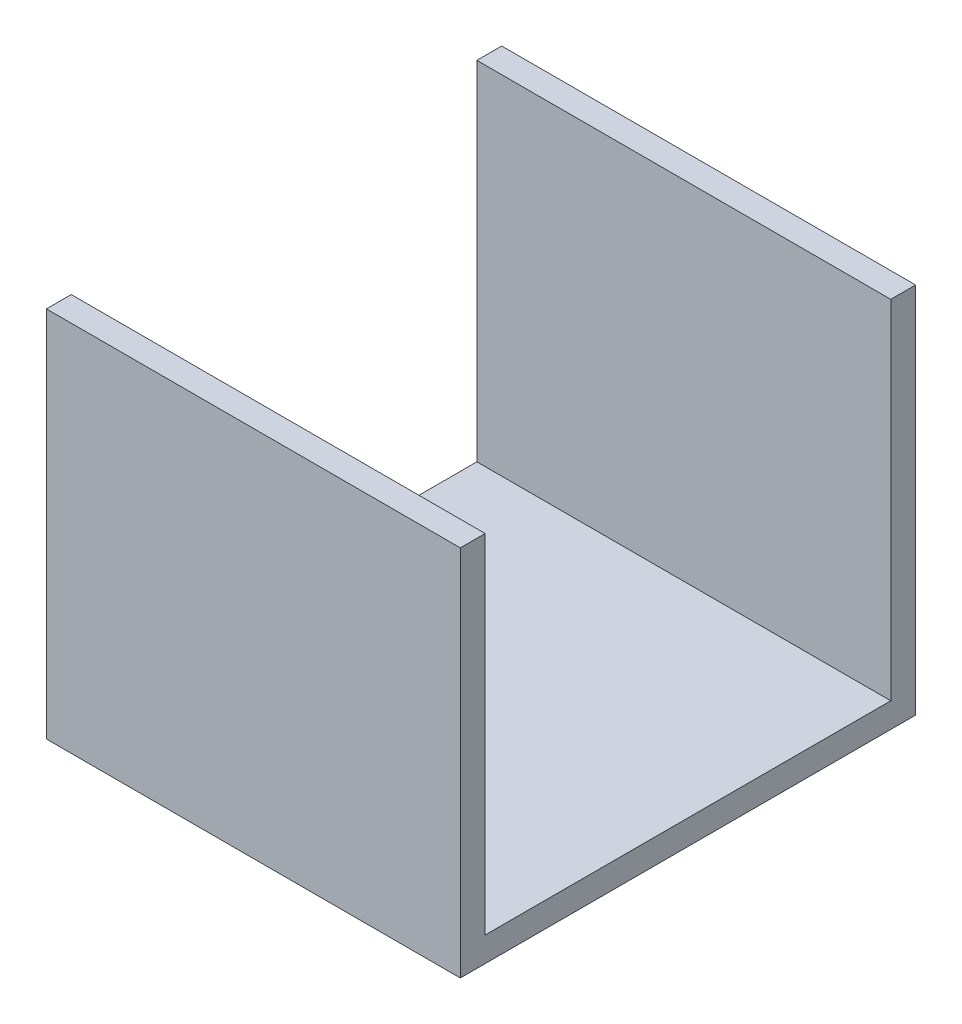
ISO-10303-21;
HEADER;
FILE_DESCRIPTION(('STEP AP214'),'2;1');
FILE_NAME('part.step','',(''),(''),'','','');
FILE_SCHEMA(('AUTOMOTIVE_DESIGN { 1 0 10303 214 1 1 1 1 }'));
ENDSEC;
DATA;
#1=APPLICATION_CONTEXT('core data for automotive mechanical design processes');
#2=APPLICATION_PROTOCOL_DEFINITION('international standard','automotive_design',2000,#1);
#3=PRODUCT_CONTEXT('',#1,'mechanical');
#4=PRODUCT('Part','Part','',(#3));
#5=PRODUCT_RELATED_PRODUCT_CATEGORY('part','',(#4));
#6=PRODUCT_DEFINITION_FORMATION('','',#4);
#7=PRODUCT_DEFINITION_CONTEXT('part definition',#1,'design');
#8=PRODUCT_DEFINITION('design','',#6,#7);
#9=PRODUCT_DEFINITION_SHAPE('','',#8);
#10=(LENGTH_UNIT() NAMED_UNIT(*) SI_UNIT(.MILLI.,.METRE.));
#11=(NAMED_UNIT(*) PLANE_ANGLE_UNIT() SI_UNIT($,.RADIAN.));
#12=(NAMED_UNIT(*) SI_UNIT($,.STERADIAN.) SOLID_ANGLE_UNIT());
#13=UNCERTAINTY_MEASURE_WITH_UNIT(LENGTH_MEASURE(1.E-05),#10,'distance_accuracy_value','');
#14=(GEOMETRIC_REPRESENTATION_CONTEXT(3) GLOBAL_UNCERTAINTY_ASSIGNED_CONTEXT((#13)) GLOBAL_UNIT_ASSIGNED_CONTEXT((#10,
#11,#12)) REPRESENTATION_CONTEXT('',''));
#15=CARTESIAN_POINT('',(0.,0.,0.));
#16=DIRECTION('',(0.,0.,1.));
#17=DIRECTION('',(1.,0.,0.));
#18=AXIS2_PLACEMENT_3D('',#15,#16,#17);
#19=CARTESIAN_POINT('',(1.45,0.005,0.));
#20=DIRECTION('',(0.,-1.,0.));
#21=DIRECTION('',(0.707106781186548,0.,0.707106781186548));
#22=AXIS2_PLACEMENT_3D('',#19,#20,#21);
#23=PLANE('',#22);
#24=DIRECTION('',(1.,0.,0.));
#25=VECTOR('',#24,1.);
#26=CARTESIAN_POINT('',(1.45,0.005,0.03));
#27=LINE('',#26,#25);
#28=CARTESIAN_POINT('',(1.45,0.005,0.03));
#29=VERTEX_POINT('',#28);
#30=CARTESIAN_POINT('',(1.95,0.005,0.03));
#31=VERTEX_POINT('',#30);
#32=EDGE_CURVE('E34',#29,#31,#27,.T.);
#33=ORIENTED_EDGE('',*,*,#32,.F.);
#34=DIRECTION('',(0.,0.,1.));
#35=VECTOR('',#34,1.);
#36=CARTESIAN_POINT('',(1.45,0.005,0.03));
#37=LINE('',#36,#35);
#38=CARTESIAN_POINT('',(1.45,0.005,0.52));
#39=VERTEX_POINT('',#38);
#40=EDGE_CURVE('E11',#29,#39,#37,.T.);
#41=ORIENTED_EDGE('',*,*,#40,.T.);
#42=DIRECTION('',(1.,0.,0.));
#43=VECTOR('',#42,1.);
#44=CARTESIAN_POINT('',(1.45,0.005,0.52));
#45=LINE('',#44,#43);
#46=CARTESIAN_POINT('',(1.95,0.005,0.52));
#47=VERTEX_POINT('',#46);
#48=EDGE_CURVE('E26',#39,#47,#45,.T.);
#49=ORIENTED_EDGE('',*,*,#48,.T.);
#50=DIRECTION('',(0.,0.,1.));
#51=VECTOR('',#50,1.);
#52=CARTESIAN_POINT('',(1.95,0.005,0.03));
#53=LINE('',#52,#51);
#54=EDGE_CURVE('E139',#31,#47,#53,.T.);
#55=ORIENTED_EDGE('',*,*,#54,.F.);
#56=EDGE_LOOP('',(#33,#41,#49,#55));
#57=FACE_BOUND('',#56,.T.);
#58=ADVANCED_FACE('F16',(#57),#23,.F.);
#59=CARTESIAN_POINT('',(1.6,0.,0.52));
#60=DIRECTION('',(0.,0.,1.));
#61=DIRECTION('',(0.707106781186548,0.707106781186548,0.));
#62=AXIS2_PLACEMENT_3D('',#59,#60,#61);
#63=PLANE('',#62);
#64=DIRECTION('',(-1.,0.,0.));
#65=VECTOR('',#64,1.);
#66=CARTESIAN_POINT('',(1.95,0.425,0.52));
#67=LINE('',#66,#65);
#68=CARTESIAN_POINT('',(1.95,0.425,0.52));
#69=VERTEX_POINT('',#68);
#70=CARTESIAN_POINT('',(1.45,0.425,0.52));
#71=VERTEX_POINT('',#70);
#72=EDGE_CURVE('E122',#69,#71,#67,.T.);
#73=ORIENTED_EDGE('',*,*,#72,.F.);
#74=DIRECTION('',(0.,1.,0.));
#75=VECTOR('',#74,1.);
#76=CARTESIAN_POINT('',(1.95,0.005,0.52));
#77=LINE('',#76,#75);
#78=EDGE_CURVE('E118',#47,#69,#77,.T.);
#79=ORIENTED_EDGE('',*,*,#78,.F.);
#80=ORIENTED_EDGE('',*,*,#48,.F.);
#81=DIRECTION('',(0.,-1.,0.));
#82=VECTOR('',#81,1.);
#83=CARTESIAN_POINT('',(1.45,0.425,0.52));
#84=LINE('',#83,#82);
#85=EDGE_CURVE('E114',#71,#39,#84,.T.);
#86=ORIENTED_EDGE('',*,*,#85,.F.);
#87=EDGE_LOOP('',(#73,#79,#80,#86));
#88=FACE_BOUND('',#87,.T.);
#89=ADVANCED_FACE('F156',(#88),#63,.F.);
#90=CARTESIAN_POINT('',(1.6,0.,0.03));
#91=DIRECTION('',(0.,0.,1.));
#92=DIRECTION('',(0.707106781186548,0.707106781186548,0.));
#93=AXIS2_PLACEMENT_3D('',#90,#91,#92);
#94=PLANE('',#93);
#95=DIRECTION('',(0.,1.,0.));
#96=VECTOR('',#95,1.);
#97=CARTESIAN_POINT('',(1.95,0.005,0.03));
#98=LINE('',#97,#96);
#99=CARTESIAN_POINT('',(1.95,0.425,0.03));
#100=VERTEX_POINT('',#99);
#101=EDGE_CURVE('E134',#31,#100,#98,.T.);
#102=ORIENTED_EDGE('',*,*,#101,.T.);
#103=DIRECTION('',(-1.,0.,0.));
#104=VECTOR('',#103,1.);
#105=CARTESIAN_POINT('',(1.95,0.425,0.03));
#106=LINE('',#105,#104);
#107=CARTESIAN_POINT('',(1.45,0.425,0.03));
#108=VERTEX_POINT('',#107);
#109=EDGE_CURVE('E131',#100,#108,#106,.T.);
#110=ORIENTED_EDGE('',*,*,#109,.T.);
#111=DIRECTION('',(0.,-1.,0.));
#112=VECTOR('',#111,1.);
#113=CARTESIAN_POINT('',(1.45,0.425,0.03));
#114=LINE('',#113,#112);
#115=EDGE_CURVE('E128',#108,#29,#114,.T.);
#116=ORIENTED_EDGE('',*,*,#115,.T.);
#117=ORIENTED_EDGE('',*,*,#32,.T.);
#118=EDGE_LOOP('',(#102,#110,#116,#117));
#119=FACE_BOUND('',#118,.T.);
#120=ADVANCED_FACE('F147',(#119),#94,.T.);
#121=CARTESIAN_POINT('',(1.95,0.425,0.));
#122=DIRECTION('',(0.,1.,0.));
#123=DIRECTION('',(0.707106781186548,0.,0.707106781186548));
#124=AXIS2_PLACEMENT_3D('',#121,#122,#123);
#125=PLANE('',#124);
#126=ORIENTED_EDGE('',*,*,#109,.F.);
#127=DIRECTION('',(0.,0.,1.));
#128=VECTOR('',#127,1.);
#129=CARTESIAN_POINT('',(1.95,0.425,0.));
#130=LINE('',#129,#128);
#131=CARTESIAN_POINT('',(1.95,0.425,0.));
#132=VERTEX_POINT('',#131);
#133=EDGE_CURVE('E102',#132,#100,#130,.T.);
#134=ORIENTED_EDGE('',*,*,#133,.F.);
#135=DIRECTION('',(-1.,0.,0.));
#136=VECTOR('',#135,1.);
#137=CARTESIAN_POINT('',(1.95,0.425,0.));
#138=LINE('',#137,#136);
#139=CARTESIAN_POINT('',(1.45,0.425,0.));
#140=VERTEX_POINT('',#139);
#141=EDGE_CURVE('E100',#132,#140,#138,.T.);
#142=ORIENTED_EDGE('',*,*,#141,.T.);
#143=DIRECTION('',(0.,0.,1.));
#144=VECTOR('',#143,1.);
#145=CARTESIAN_POINT('',(1.45,0.425,0.));
#146=LINE('',#145,#144);
#147=EDGE_CURVE('E123',#140,#108,#146,.T.);
#148=ORIENTED_EDGE('',*,*,#147,.T.);
#149=EDGE_LOOP('',(#126,#134,#142,#148));
#150=FACE_BOUND('',#149,.T.);
#151=ADVANCED_FACE('F149',(#150),#125,.T.);
#152=CARTESIAN_POINT('',(1.95,0.425,0.));
#153=DIRECTION('',(0.,1.,0.));
#154=DIRECTION('',(0.707106781186548,0.,0.707106781186548));
#155=AXIS2_PLACEMENT_3D('',#152,#153,#154);
#156=PLANE('',#155);
#157=ORIENTED_EDGE('',*,*,#72,.T.);
#158=DIRECTION('',(0.,0.,1.));
#159=VECTOR('',#158,1.);
#160=CARTESIAN_POINT('',(1.45,0.425,0.52));
#161=LINE('',#160,#159);
#162=CARTESIAN_POINT('',(1.45,0.425,0.55));
#163=VERTEX_POINT('',#162);
#164=EDGE_CURVE('E116',#71,#163,#161,.T.);
#165=ORIENTED_EDGE('',*,*,#164,.T.);
#166=DIRECTION('',(-1.,0.,0.));
#167=VECTOR('',#166,1.);
#168=CARTESIAN_POINT('',(1.95,0.425,0.55));
#169=LINE('',#168,#167);
#170=CARTESIAN_POINT('',(1.95,0.425,0.55));
#171=VERTEX_POINT('',#170);
#172=EDGE_CURVE('E111',#171,#163,#169,.T.);
#173=ORIENTED_EDGE('',*,*,#172,.F.);
#174=DIRECTION('',(0.,0.,1.));
#175=VECTOR('',#174,1.);
#176=CARTESIAN_POINT('',(1.95,0.425,0.52));
#177=LINE('',#176,#175);
#178=EDGE_CURVE('E101',#69,#171,#177,.T.);
#179=ORIENTED_EDGE('',*,*,#178,.F.);
#180=EDGE_LOOP('',(#157,#165,#173,#179));
#181=FACE_BOUND('',#180,.T.);
#182=ADVANCED_FACE('F162',(#181),#156,.T.);
#183=CARTESIAN_POINT('',(1.45,0.425,0.));
#184=DIRECTION('',(-1.,0.,0.));
#185=DIRECTION('',(0.,0.707106781186548,0.707106781186548));
#186=AXIS2_PLACEMENT_3D('',#183,#184,#185);
#187=PLANE('',#186);
#188=ORIENTED_EDGE('',*,*,#115,.F.);
#189=ORIENTED_EDGE('',*,*,#147,.F.);
#190=DIRECTION('',(0.,-1.,0.));
#191=VECTOR('',#190,1.);
#192=CARTESIAN_POINT('',(1.45,0.425,0.));
#193=LINE('',#192,#191);
#194=CARTESIAN_POINT('',(1.45,-0.025,0.));
#195=VERTEX_POINT('',#194);
#196=EDGE_CURVE('E113',#140,#195,#193,.T.);
#197=ORIENTED_EDGE('',*,*,#196,.T.);
#198=DIRECTION('',(0.,0.,1.));
#199=VECTOR('',#198,1.);
#200=CARTESIAN_POINT('',(1.45,-0.025,0.));
#201=LINE('',#200,#199);
#202=CARTESIAN_POINT('',(1.45,-0.025,0.55));
#203=VERTEX_POINT('',#202);
#204=EDGE_CURVE('E105',#195,#203,#201,.T.);
#205=ORIENTED_EDGE('',*,*,#204,.T.);
#206=DIRECTION('',(0.,-1.,0.));
#207=VECTOR('',#206,1.);
#208=CARTESIAN_POINT('',(1.45,0.425,0.55));
#209=LINE('',#208,#207);
#210=EDGE_CURVE('E109',#163,#203,#209,.T.);
#211=ORIENTED_EDGE('',*,*,#210,.F.);
#212=ORIENTED_EDGE('',*,*,#164,.F.);
#213=ORIENTED_EDGE('',*,*,#85,.T.);
#214=ORIENTED_EDGE('',*,*,#40,.F.);
#215=EDGE_LOOP('',(#188,#189,#197,#205,#211,#212,#213,#214));
#216=FACE_BOUND('',#215,.T.);
#217=ADVANCED_FACE('F151',(#216),#187,.T.);
#218=CARTESIAN_POINT('',(1.95,-0.025,0.));
#219=DIRECTION('',(1.,0.,0.));
#220=DIRECTION('',(0.,0.707106781186548,0.707106781186548));
#221=AXIS2_PLACEMENT_3D('',#218,#219,#220);
#222=PLANE('',#221);
#223=ORIENTED_EDGE('',*,*,#101,.F.);
#224=ORIENTED_EDGE('',*,*,#54,.T.);
#225=ORIENTED_EDGE('',*,*,#78,.T.);
#226=ORIENTED_EDGE('',*,*,#178,.T.);
#227=DIRECTION('',(0.,1.,0.));
#228=VECTOR('',#227,1.);
#229=CARTESIAN_POINT('',(1.95,-0.025,0.55));
#230=LINE('',#229,#228);
#231=CARTESIAN_POINT('',(1.95,-0.025,0.55));
#232=VERTEX_POINT('',#231);
#233=EDGE_CURVE('E90',#232,#171,#230,.T.);
#234=ORIENTED_EDGE('',*,*,#233,.F.);
#235=DIRECTION('',(0.,0.,1.));
#236=VECTOR('',#235,1.);
#237=CARTESIAN_POINT('',(1.95,-0.025,0.));
#238=LINE('',#237,#236);
#239=CARTESIAN_POINT('',(1.95,-0.025,0.));
#240=VERTEX_POINT('',#239);
#241=EDGE_CURVE('E79',#240,#232,#238,.T.);
#242=ORIENTED_EDGE('',*,*,#241,.F.);
#243=DIRECTION('',(0.,1.,0.));
#244=VECTOR('',#243,1.);
#245=CARTESIAN_POINT('',(1.95,-0.025,0.));
#246=LINE('',#245,#244);
#247=EDGE_CURVE('E87',#240,#132,#246,.T.);
#248=ORIENTED_EDGE('',*,*,#247,.T.);
#249=ORIENTED_EDGE('',*,*,#133,.T.);
#250=EDGE_LOOP('',(#223,#224,#225,#226,#234,#242,#248,#249));
#251=FACE_BOUND('',#250,.T.);
#252=ADVANCED_FACE('F85',(#251),#222,.T.);
#253=CARTESIAN_POINT('',(1.6,0.,0.));
#254=DIRECTION('',(0.,0.,1.));
#255=DIRECTION('',(0.707106781186548,0.707106781186548,0.));
#256=AXIS2_PLACEMENT_3D('',#253,#254,#255);
#257=PLANE('',#256);
#258=ORIENTED_EDGE('',*,*,#247,.F.);
#259=DIRECTION('',(1.,0.,0.));
#260=VECTOR('',#259,1.);
#261=CARTESIAN_POINT('',(1.45,-0.025,0.));
#262=LINE('',#261,#260);
#263=EDGE_CURVE('E92',#195,#240,#262,.T.);
#264=ORIENTED_EDGE('',*,*,#263,.F.);
#265=ORIENTED_EDGE('',*,*,#196,.F.);
#266=ORIENTED_EDGE('',*,*,#141,.F.);
#267=EDGE_LOOP('',(#258,#264,#265,#266));
#268=FACE_BOUND('',#267,.T.);
#269=ADVANCED_FACE('F97',(#268),#257,.F.);
#270=CARTESIAN_POINT('',(1.6,0.,0.55));
#271=DIRECTION('',(0.,0.,1.));
#272=DIRECTION('',(0.707106781186548,0.707106781186548,0.));
#273=AXIS2_PLACEMENT_3D('',#270,#271,#272);
#274=PLANE('',#273);
#275=ORIENTED_EDGE('',*,*,#172,.T.);
#276=ORIENTED_EDGE('',*,*,#210,.T.);
#277=DIRECTION('',(1.,0.,0.));
#278=VECTOR('',#277,1.);
#279=CARTESIAN_POINT('',(1.45,-0.025,0.55));
#280=LINE('',#279,#278);
#281=EDGE_CURVE('E20',#203,#232,#280,.T.);
#282=ORIENTED_EDGE('',*,*,#281,.T.);
#283=ORIENTED_EDGE('',*,*,#233,.T.);
#284=EDGE_LOOP('',(#275,#276,#282,#283));
#285=FACE_BOUND('',#284,.T.);
#286=ADVANCED_FACE('F160',(#285),#274,.T.);
#287=CARTESIAN_POINT('',(1.45,-0.025,0.));
#288=DIRECTION('',(0.,-1.,0.));
#289=DIRECTION('',(0.707106781186548,0.,0.707106781186548));
#290=AXIS2_PLACEMENT_3D('',#287,#288,#289);
#291=PLANE('',#290);
#292=ORIENTED_EDGE('',*,*,#263,.T.);
#293=ORIENTED_EDGE('',*,*,#241,.T.);
#294=ORIENTED_EDGE('',*,*,#281,.F.);
#295=ORIENTED_EDGE('',*,*,#204,.F.);
#296=EDGE_LOOP('',(#292,#293,#294,#295));
#297=FACE_BOUND('',#296,.T.);
#298=ADVANCED_FACE('F18',(#297),#291,.T.);
#299=CLOSED_SHELL('',(#58,#89,#120,#151,#182,#217,#252,#269,#286,#298));
#300=MANIFOLD_SOLID_BREP('B1',#299);
#301=ADVANCED_BREP_SHAPE_REPRESENTATION('',(#18,#300),#14);
#302=SHAPE_DEFINITION_REPRESENTATION(#9,#301);
ENDSEC;
END-ISO-10303-21;
